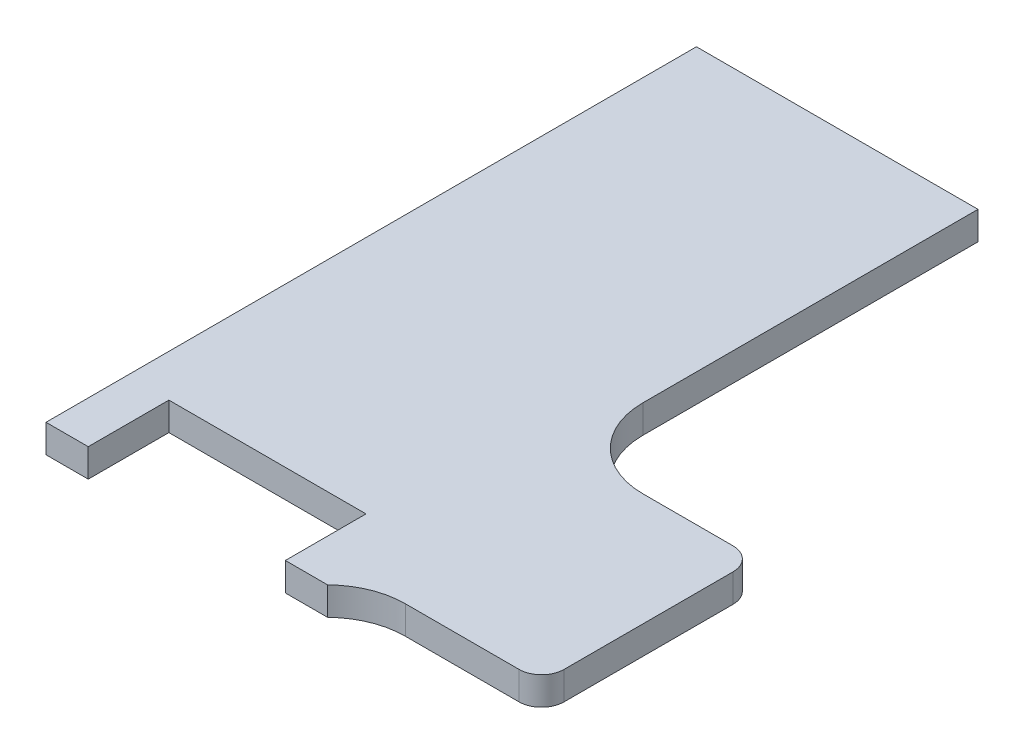
ISO-10303-21;
HEADER;
FILE_DESCRIPTION(('STEP AP214'),'2;1');
FILE_NAME('part.step','',(''),(''),'','','');
FILE_SCHEMA(('AUTOMOTIVE_DESIGN { 1 0 10303 214 1 1 1 1 }'));
ENDSEC;
DATA;
#1=APPLICATION_CONTEXT('core data for automotive mechanical design processes');
#2=APPLICATION_PROTOCOL_DEFINITION('international standard','automotive_design',2000,#1);
#3=PRODUCT_CONTEXT('',#1,'mechanical');
#4=PRODUCT('Part','Part','',(#3));
#5=PRODUCT_RELATED_PRODUCT_CATEGORY('part','',(#4));
#6=PRODUCT_DEFINITION_FORMATION('','',#4);
#7=PRODUCT_DEFINITION_CONTEXT('part definition',#1,'design');
#8=PRODUCT_DEFINITION('design','',#6,#7);
#9=PRODUCT_DEFINITION_SHAPE('','',#8);
#10=(LENGTH_UNIT() NAMED_UNIT(*) SI_UNIT(.MILLI.,.METRE.));
#11=(NAMED_UNIT(*) PLANE_ANGLE_UNIT() SI_UNIT($,.RADIAN.));
#12=(NAMED_UNIT(*) SI_UNIT($,.STERADIAN.) SOLID_ANGLE_UNIT());
#13=UNCERTAINTY_MEASURE_WITH_UNIT(LENGTH_MEASURE(1.E-05),#10,'distance_accuracy_value','');
#14=(GEOMETRIC_REPRESENTATION_CONTEXT(3) GLOBAL_UNCERTAINTY_ASSIGNED_CONTEXT((#13)) GLOBAL_UNIT_ASSIGNED_CONTEXT((#10,
#11,#12)) REPRESENTATION_CONTEXT('',''));
#15=CARTESIAN_POINT('',(0.,0.,0.));
#16=DIRECTION('',(0.,0.,1.));
#17=DIRECTION('',(1.,0.,0.));
#18=AXIS2_PLACEMENT_3D('',#15,#16,#17);
#19=CARTESIAN_POINT('',(31.75,39.6875,-24.765));
#20=DIRECTION('',(1.,0.,0.));
#21=DIRECTION('',(0.,0.,-1.));
#22=AXIS2_PLACEMENT_3D('',#19,#20,#21);
#23=PLANE('',#22);
#24=DIRECTION('',(0.,0.,-1.));
#25=VECTOR('',#24,1.);
#26=CARTESIAN_POINT('',(31.75,96.8375,20.32));
#27=LINE('',#26,#25);
#28=CARTESIAN_POINT('',(31.75,96.8375,-50.8));
#29=VERTEX_POINT('',#28);
#30=CARTESIAN_POINT('',(31.75,96.8375,-126.365));
#31=VERTEX_POINT('',#30);
#32=EDGE_CURVE('E169',#29,#31,#27,.T.);
#33=ORIENTED_EDGE('',*,*,#32,.F.);
#34=DIRECTION('',(0.,1.,0.));
#35=VECTOR('',#34,1.);
#36=CARTESIAN_POINT('',(31.75,90.4875,-50.8));
#37=LINE('',#36,#35);
#38=CARTESIAN_POINT('',(31.75,90.4875,-50.8));
#39=VERTEX_POINT('',#38);
#40=EDGE_CURVE('E201',#29,#39,#37,.F.);
#41=ORIENTED_EDGE('',*,*,#40,.T.);
#42=DIRECTION('',(0.,0.,-1.));
#43=VECTOR('',#42,1.);
#44=CARTESIAN_POINT('',(31.75,90.4875,-24.765));
#45=LINE('',#44,#43);
#46=CARTESIAN_POINT('',(31.75,90.4875,-126.365));
#47=VERTEX_POINT('',#46);
#48=EDGE_CURVE('E181',#39,#47,#45,.T.);
#49=ORIENTED_EDGE('',*,*,#48,.T.);
#50=DIRECTION('',(0.,-1.,0.));
#51=VECTOR('',#50,1.);
#52=CARTESIAN_POINT('',(31.75,96.8375,-126.365));
#53=LINE('',#52,#51);
#54=EDGE_CURVE('E190',#31,#47,#53,.T.);
#55=ORIENTED_EDGE('',*,*,#54,.F.);
#56=EDGE_LOOP('',(#33,#41,#49,#55));
#57=FACE_BOUND('',#56,.T.);
#58=ADVANCED_FACE('F36',(#57),#23,.T.);
#59=CARTESIAN_POINT('',(-31.75,96.8375,20.32));
#60=DIRECTION('',(0.,0.,-1.));
#61=DIRECTION('',(-1.,0.,0.));
#62=AXIS2_PLACEMENT_3D('',#59,#60,#61);
#63=PLANE('',#62);
#64=DIRECTION('',(0.,1.,0.));
#65=VECTOR('',#64,1.);
#66=CARTESIAN_POINT('',(-22.225,-0.00100000000002876,20.32));
#67=LINE('',#66,#65);
#68=CARTESIAN_POINT('',(-22.225,90.4875,20.32));
#69=VERTEX_POINT('',#68);
#70=CARTESIAN_POINT('',(-22.225,96.8375,20.32));
#71=VERTEX_POINT('',#70);
#72=EDGE_CURVE('E145',#69,#71,#67,.T.);
#73=ORIENTED_EDGE('',*,*,#72,.T.);
#74=DIRECTION('',(1.,0.,0.));
#75=VECTOR('',#74,1.);
#76=CARTESIAN_POINT('',(-31.75,96.8375,20.32));
#77=LINE('',#76,#75);
#78=CARTESIAN_POINT('',(-31.75,96.8375,20.32));
#79=VERTEX_POINT('',#78);
#80=EDGE_CURVE('E159',#79,#71,#77,.T.);
#81=ORIENTED_EDGE('',*,*,#80,.F.);
#82=DIRECTION('',(0.,-1.,0.));
#83=VECTOR('',#82,1.);
#84=CARTESIAN_POINT('',(-31.75,96.8375,20.32));
#85=LINE('',#84,#83);
#86=CARTESIAN_POINT('',(-31.75,90.4875,20.32));
#87=VERTEX_POINT('',#86);
#88=EDGE_CURVE('E196',#79,#87,#85,.T.);
#89=ORIENTED_EDGE('',*,*,#88,.T.);
#90=DIRECTION('',(1.,0.,0.));
#91=VECTOR('',#90,1.);
#92=CARTESIAN_POINT('',(-31.75,90.4875,20.32));
#93=LINE('',#92,#91);
#94=EDGE_CURVE('E161',#87,#69,#93,.T.);
#95=ORIENTED_EDGE('',*,*,#94,.T.);
#96=EDGE_LOOP('',(#73,#81,#89,#95));
#97=FACE_BOUND('',#96,.T.);
#98=ADVANCED_FACE('F157',(#97),#63,.F.);
#99=CARTESIAN_POINT('',(0.,96.8375,0.));
#100=DIRECTION('',(0.,1.,0.));
#101=DIRECTION('',(-1.,0.,0.));
#102=AXIS2_PLACEMENT_3D('',#99,#100,#101);
#103=PLANE('',#102);
#104=DIRECTION('',(0.,0.,-1.));
#105=VECTOR('',#104,1.);
#106=CARTESIAN_POINT('',(74.93,96.8375,15.24));
#107=LINE('',#106,#105);
#108=CARTESIAN_POINT('',(74.93,96.8375,10.16));
#109=VERTEX_POINT('',#108);
#110=CARTESIAN_POINT('',(74.93,96.8375,-27.94));
#111=VERTEX_POINT('',#110);
#112=EDGE_CURVE('E232',#109,#111,#107,.T.);
#113=ORIENTED_EDGE('',*,*,#112,.T.);
#114=CARTESIAN_POINT('',(69.85,96.8375,-27.94));
#115=DIRECTION('',(0.,1.,0.));
#116=DIRECTION('',(-1.,0.,0.));
#117=AXIS2_PLACEMENT_3D('',#114,#115,#116);
#118=CIRCLE('',#117,5.08);
#119=CARTESIAN_POINT('',(69.85,96.8375,-33.02));
#120=VERTEX_POINT('',#119);
#121=EDGE_CURVE('E58',#111,#120,#118,.T.);
#122=ORIENTED_EDGE('',*,*,#121,.T.);
#123=DIRECTION('',(-1.,0.,0.));
#124=VECTOR('',#123,1.);
#125=CARTESIAN_POINT('',(31.75,96.8375,-33.02));
#126=LINE('',#125,#124);
#127=CARTESIAN_POINT('',(49.53,96.8375,-33.02));
#128=VERTEX_POINT('',#127);
#129=EDGE_CURVE('E238',#120,#128,#126,.T.);
#130=ORIENTED_EDGE('',*,*,#129,.T.);
#131=CARTESIAN_POINT('',(49.53,96.8375,-50.8));
#132=DIRECTION('',(0.,1.,0.));
#133=DIRECTION('',(-1.,0.,0.));
#134=AXIS2_PLACEMENT_3D('',#131,#132,#133);
#135=CIRCLE('',#134,17.78);
#136=EDGE_CURVE('E203',#128,#29,#135,.F.);
#137=ORIENTED_EDGE('',*,*,#136,.T.);
#138=ORIENTED_EDGE('',*,*,#32,.T.);
#139=DIRECTION('',(-1.,0.,0.));
#140=VECTOR('',#139,1.);
#141=CARTESIAN_POINT('',(31.75,96.8375,-126.365));
#142=LINE('',#141,#140);
#143=CARTESIAN_POINT('',(-31.75,96.8375,-126.365));
#144=VERTEX_POINT('',#143);
#145=EDGE_CURVE('E172',#31,#144,#142,.T.);
#146=ORIENTED_EDGE('',*,*,#145,.T.);
#147=DIRECTION('',(0.,0.,1.));
#148=VECTOR('',#147,1.);
#149=CARTESIAN_POINT('',(-31.75,96.8375,-24.765));
#150=LINE('',#149,#148);
#151=EDGE_CURVE('E167',#144,#79,#150,.T.);
#152=ORIENTED_EDGE('',*,*,#151,.T.);
#153=ORIENTED_EDGE('',*,*,#80,.T.);
#154=DIRECTION('',(0.,0.,-1.));
#155=VECTOR('',#154,1.);
#156=CARTESIAN_POINT('',(-22.225,96.8375,41.1636421541246));
#157=LINE('',#156,#155);
#158=CARTESIAN_POINT('',(-22.225,96.8375,2.13002217265057));
#159=VERTEX_POINT('',#158);
#160=EDGE_CURVE('E141',#71,#159,#157,.T.);
#161=ORIENTED_EDGE('',*,*,#160,.T.);
#162=DIRECTION('',(-1.,0.,0.));
#163=VECTOR('',#162,1.);
#164=CARTESIAN_POINT('',(22.225,96.8375,2.13002217265057));
#165=LINE('',#164,#163);
#166=CARTESIAN_POINT('',(22.225,96.8375,2.13002217265057));
#167=VERTEX_POINT('',#166);
#168=EDGE_CURVE('E152',#167,#159,#165,.T.);
#169=ORIENTED_EDGE('',*,*,#168,.F.);
#170=DIRECTION('',(0.,0.,-1.));
#171=VECTOR('',#170,1.);
#172=CARTESIAN_POINT('',(22.225,96.8375,41.1636421541246));
#173=LINE('',#172,#171);
#174=CARTESIAN_POINT('',(22.225,96.8375,20.32));
#175=VERTEX_POINT('',#174);
#176=EDGE_CURVE('E252',#175,#167,#173,.T.);
#177=ORIENTED_EDGE('',*,*,#176,.F.);
#178=CARTESIAN_POINT('',(31.75,96.8375,20.32));
#179=VERTEX_POINT('',#178);
#180=EDGE_CURVE('E170',#175,#179,#77,.T.);
#181=ORIENTED_EDGE('',*,*,#180,.T.);
#182=CARTESIAN_POINT('',(44.1934078933385,96.8375,33.02));
#183=DIRECTION('',(0.,1.,0.));
#184=DIRECTION('',(-1.,0.,0.));
#185=AXIS2_PLACEMENT_3D('',#182,#183,#184);
#186=CIRCLE('',#185,17.78);
#187=CARTESIAN_POINT('',(44.1934078933385,96.8375,15.24));
#188=VERTEX_POINT('',#187);
#189=EDGE_CURVE('E210',#179,#188,#186,.F.);
#190=ORIENTED_EDGE('',*,*,#189,.T.);
#191=DIRECTION('',(1.,0.,0.));
#192=VECTOR('',#191,1.);
#193=CARTESIAN_POINT('',(31.75,96.8375,15.24));
#194=LINE('',#193,#192);
#195=CARTESIAN_POINT('',(69.85,96.8375,15.24));
#196=VERTEX_POINT('',#195);
#197=EDGE_CURVE('E239',#188,#196,#194,.T.);
#198=ORIENTED_EDGE('',*,*,#197,.T.);
#199=CARTESIAN_POINT('',(69.85,96.8375,10.16));
#200=DIRECTION('',(0.,1.,0.));
#201=DIRECTION('',(-1.,0.,0.));
#202=AXIS2_PLACEMENT_3D('',#199,#200,#201);
#203=CIRCLE('',#202,5.08);
#204=EDGE_CURVE('E217',#196,#109,#203,.T.);
#205=ORIENTED_EDGE('',*,*,#204,.T.);
#206=EDGE_LOOP('',(#113,#122,#130,#137,#138,#146,#152,#153,#161,#169,#177,#181,#190,#198,#205));
#207=FACE_BOUND('',#206,.T.);
#208=ADVANCED_FACE('F165',(#207),#103,.T.);
#209=CARTESIAN_POINT('',(-31.75,90.4875,-24.765));
#210=DIRECTION('',(-1.,0.,0.));
#211=DIRECTION('',(0.,-1.,0.));
#212=AXIS2_PLACEMENT_3D('',#209,#210,#211);
#213=PLANE('',#212);
#214=DIRECTION('',(0.,0.,1.));
#215=VECTOR('',#214,1.);
#216=CARTESIAN_POINT('',(-31.75,90.4875,-24.765));
#217=LINE('',#216,#215);
#218=CARTESIAN_POINT('',(-31.75,90.4875,-126.365));
#219=VERTEX_POINT('',#218);
#220=EDGE_CURVE('E186',#219,#87,#217,.T.);
#221=ORIENTED_EDGE('',*,*,#220,.T.);
#222=ORIENTED_EDGE('',*,*,#88,.F.);
#223=ORIENTED_EDGE('',*,*,#151,.F.);
#224=DIRECTION('',(0.,-1.,0.));
#225=VECTOR('',#224,1.);
#226=CARTESIAN_POINT('',(-31.75,96.8375,-126.365));
#227=LINE('',#226,#225);
#228=EDGE_CURVE('E179',#144,#219,#227,.T.);
#229=ORIENTED_EDGE('',*,*,#228,.T.);
#230=EDGE_LOOP('',(#221,#222,#223,#229));
#231=FACE_BOUND('',#230,.T.);
#232=ADVANCED_FACE('F283',(#231),#213,.T.);
#233=CARTESIAN_POINT('',(0.,90.4875,0.));
#234=DIRECTION('',(0.,1.,0.));
#235=DIRECTION('',(-1.,0.,0.));
#236=AXIS2_PLACEMENT_3D('',#233,#234,#235);
#237=PLANE('',#236);
#238=ORIENTED_EDGE('',*,*,#94,.F.);
#239=ORIENTED_EDGE('',*,*,#220,.F.);
#240=DIRECTION('',(-1.,0.,0.));
#241=VECTOR('',#240,1.);
#242=CARTESIAN_POINT('',(31.75,90.4875,-126.365));
#243=LINE('',#242,#241);
#244=EDGE_CURVE('E184',#47,#219,#243,.T.);
#245=ORIENTED_EDGE('',*,*,#244,.F.);
#246=ORIENTED_EDGE('',*,*,#48,.F.);
#247=CARTESIAN_POINT('',(49.53,90.4875,-50.8));
#248=DIRECTION('',(0.,1.,0.));
#249=DIRECTION('',(-1.,0.,0.));
#250=AXIS2_PLACEMENT_3D('',#247,#248,#249);
#251=CIRCLE('',#250,17.78);
#252=CARTESIAN_POINT('',(49.53,90.4875,-33.02));
#253=VERTEX_POINT('',#252);
#254=EDGE_CURVE('E205',#39,#253,#251,.T.);
#255=ORIENTED_EDGE('',*,*,#254,.T.);
#256=DIRECTION('',(1.,0.,0.));
#257=VECTOR('',#256,1.);
#258=CARTESIAN_POINT('',(31.75,90.4875,-33.02));
#259=LINE('',#258,#257);
#260=CARTESIAN_POINT('',(69.85,90.4875,-33.02));
#261=VERTEX_POINT('',#260);
#262=EDGE_CURVE('E245',#253,#261,#259,.T.);
#263=ORIENTED_EDGE('',*,*,#262,.T.);
#264=CARTESIAN_POINT('',(69.85,90.4875,-27.94));
#265=DIRECTION('',(0.,1.,0.));
#266=DIRECTION('',(-1.,0.,0.));
#267=AXIS2_PLACEMENT_3D('',#264,#265,#266);
#268=CIRCLE('',#267,5.08);
#269=CARTESIAN_POINT('',(74.93,90.4875,-27.94));
#270=VERTEX_POINT('',#269);
#271=EDGE_CURVE('E11',#261,#270,#268,.F.);
#272=ORIENTED_EDGE('',*,*,#271,.T.);
#273=DIRECTION('',(0.,0.,1.));
#274=VECTOR('',#273,1.);
#275=CARTESIAN_POINT('',(74.93,90.4875,15.24));
#276=LINE('',#275,#274);
#277=CARTESIAN_POINT('',(74.93,90.4875,10.16));
#278=VERTEX_POINT('',#277);
#279=EDGE_CURVE('E234',#270,#278,#276,.T.);
#280=ORIENTED_EDGE('',*,*,#279,.T.);
#281=CARTESIAN_POINT('',(69.85,90.4875,10.16));
#282=DIRECTION('',(0.,1.,0.));
#283=DIRECTION('',(-1.,0.,0.));
#284=AXIS2_PLACEMENT_3D('',#281,#282,#283);
#285=CIRCLE('',#284,5.08);
#286=CARTESIAN_POINT('',(69.85,90.4875,15.24));
#287=VERTEX_POINT('',#286);
#288=EDGE_CURVE('E222',#278,#287,#285,.F.);
#289=ORIENTED_EDGE('',*,*,#288,.T.);
#290=DIRECTION('',(-1.,0.,0.));
#291=VECTOR('',#290,1.);
#292=CARTESIAN_POINT('',(31.75,90.4875,15.24));
#293=LINE('',#292,#291);
#294=CARTESIAN_POINT('',(44.1934078933385,90.4875,15.24));
#295=VERTEX_POINT('',#294);
#296=EDGE_CURVE('E163',#287,#295,#293,.T.);
#297=ORIENTED_EDGE('',*,*,#296,.T.);
#298=CARTESIAN_POINT('',(44.1934078933385,90.4875,33.02));
#299=DIRECTION('',(0.,1.,0.));
#300=DIRECTION('',(-1.,0.,0.));
#301=AXIS2_PLACEMENT_3D('',#298,#299,#300);
#302=CIRCLE('',#301,17.78);
#303=CARTESIAN_POINT('',(31.75,90.4875,20.32));
#304=VERTEX_POINT('',#303);
#305=EDGE_CURVE('E212',#295,#304,#302,.T.);
#306=ORIENTED_EDGE('',*,*,#305,.T.);
#307=CARTESIAN_POINT('',(22.225,90.4875,20.32));
#308=VERTEX_POINT('',#307);
#309=EDGE_CURVE('E182',#308,#304,#93,.T.);
#310=ORIENTED_EDGE('',*,*,#309,.F.);
#311=DIRECTION('',(0.,0.,1.));
#312=VECTOR('',#311,1.);
#313=CARTESIAN_POINT('',(22.225,90.4875,41.1636421541246));
#314=LINE('',#313,#312);
#315=CARTESIAN_POINT('',(22.225,90.4875,2.13002217265057));
#316=VERTEX_POINT('',#315);
#317=EDGE_CURVE('E250',#316,#308,#314,.T.);
#318=ORIENTED_EDGE('',*,*,#317,.F.);
#319=DIRECTION('',(1.,0.,0.));
#320=VECTOR('',#319,1.);
#321=CARTESIAN_POINT('',(22.225,90.4875,2.13002217265057));
#322=LINE('',#321,#320);
#323=CARTESIAN_POINT('',(-22.225,90.4875,2.13002217265057));
#324=VERTEX_POINT('',#323);
#325=EDGE_CURVE('E257',#324,#316,#322,.T.);
#326=ORIENTED_EDGE('',*,*,#325,.F.);
#327=DIRECTION('',(0.,0.,1.));
#328=VECTOR('',#327,1.);
#329=CARTESIAN_POINT('',(-22.225,90.4875,41.1636421541246));
#330=LINE('',#329,#328);
#331=EDGE_CURVE('E248',#324,#69,#330,.T.);
#332=ORIENTED_EDGE('',*,*,#331,.T.);
#333=EDGE_LOOP('',(#238,#239,#245,#246,#255,#263,#272,#280,#289,#297,#306,#310,#318,#326,#332));
#334=FACE_BOUND('',#333,.T.);
#335=ADVANCED_FACE('F278',(#334),#237,.F.);
#336=ORIENTED_EDGE('',*,*,#180,.F.);
#337=DIRECTION('',(0.,1.,0.));
#338=VECTOR('',#337,1.);
#339=CARTESIAN_POINT('',(22.225,-0.00100000000002876,20.32));
#340=LINE('',#339,#338);
#341=EDGE_CURVE('E162',#308,#175,#340,.T.);
#342=ORIENTED_EDGE('',*,*,#341,.F.);
#343=ORIENTED_EDGE('',*,*,#309,.T.);
#344=DIRECTION('',(0.,-1.,0.));
#345=VECTOR('',#344,1.);
#346=CARTESIAN_POINT('',(31.75,96.8375,20.32));
#347=LINE('',#346,#345);
#348=EDGE_CURVE('E193',#179,#304,#347,.T.);
#349=ORIENTED_EDGE('',*,*,#348,.F.);
#350=EDGE_LOOP('',(#336,#342,#343,#349));
#351=FACE_BOUND('',#350,.T.);
#352=ADVANCED_FACE('F267',(#351),#63,.F.);
#353=CARTESIAN_POINT('',(31.75,96.8375,-126.365));
#354=DIRECTION('',(0.,0.,1.));
#355=DIRECTION('',(1.,0.,0.));
#356=AXIS2_PLACEMENT_3D('',#353,#354,#355);
#357=PLANE('',#356);
#358=ORIENTED_EDGE('',*,*,#244,.T.);
#359=ORIENTED_EDGE('',*,*,#228,.F.);
#360=ORIENTED_EDGE('',*,*,#145,.F.);
#361=ORIENTED_EDGE('',*,*,#54,.T.);
#362=EDGE_LOOP('',(#358,#359,#360,#361));
#363=FACE_BOUND('',#362,.T.);
#364=ADVANCED_FACE('F287',(#363),#357,.F.);
#365=CARTESIAN_POINT('',(22.225,-0.00100000000002876,2.13002217265057));
#366=DIRECTION('',(0.,0.,-1.));
#367=DIRECTION('',(-1.,0.,0.));
#368=AXIS2_PLACEMENT_3D('',#365,#366,#367);
#369=PLANE('',#368);
#370=ORIENTED_EDGE('',*,*,#325,.T.);
#371=DIRECTION('',(0.,1.,0.));
#372=VECTOR('',#371,1.);
#373=CARTESIAN_POINT('',(22.225,-0.00100000000002876,2.13002217265057));
#374=LINE('',#373,#372);
#375=EDGE_CURVE('E151',#316,#167,#374,.T.);
#376=ORIENTED_EDGE('',*,*,#375,.T.);
#377=ORIENTED_EDGE('',*,*,#168,.T.);
#378=DIRECTION('',(0.,1.,0.));
#379=VECTOR('',#378,1.);
#380=CARTESIAN_POINT('',(-22.225,-0.00100000000002876,2.13002217265057));
#381=LINE('',#380,#379);
#382=EDGE_CURVE('E147',#324,#159,#381,.T.);
#383=ORIENTED_EDGE('',*,*,#382,.F.);
#384=EDGE_LOOP('',(#370,#376,#377,#383));
#385=FACE_BOUND('',#384,.T.);
#386=ADVANCED_FACE('F369',(#385),#369,.F.);
#387=CARTESIAN_POINT('',(-22.225,-0.00100000000002876,41.1636421541246));
#388=DIRECTION('',(1.,0.,0.));
#389=DIRECTION('',(0.,1.,0.));
#390=AXIS2_PLACEMENT_3D('',#387,#388,#389);
#391=PLANE('',#390);
#392=ORIENTED_EDGE('',*,*,#331,.F.);
#393=ORIENTED_EDGE('',*,*,#382,.T.);
#394=ORIENTED_EDGE('',*,*,#160,.F.);
#395=ORIENTED_EDGE('',*,*,#72,.F.);
#396=EDGE_LOOP('',(#392,#393,#394,#395));
#397=FACE_BOUND('',#396,.T.);
#398=ADVANCED_FACE('F144',(#397),#391,.T.);
#399=CARTESIAN_POINT('',(22.225,-0.00100000000002876,41.1636421541246));
#400=DIRECTION('',(1.,0.,0.));
#401=DIRECTION('',(0.,1.,0.));
#402=AXIS2_PLACEMENT_3D('',#399,#400,#401);
#403=PLANE('',#402);
#404=ORIENTED_EDGE('',*,*,#341,.T.);
#405=ORIENTED_EDGE('',*,*,#176,.T.);
#406=ORIENTED_EDGE('',*,*,#375,.F.);
#407=ORIENTED_EDGE('',*,*,#317,.T.);
#408=EDGE_LOOP('',(#404,#405,#406,#407));
#409=FACE_BOUND('',#408,.T.);
#410=ADVANCED_FACE('F277',(#409),#403,.F.);
#411=CARTESIAN_POINT('',(31.75,25.7299521773716,-33.02));
#412=DIRECTION('',(0.,0.,-1.));
#413=DIRECTION('',(-1.,0.,0.));
#414=AXIS2_PLACEMENT_3D('',#411,#412,#413);
#415=PLANE('',#414);
#416=ORIENTED_EDGE('',*,*,#129,.F.);
#417=DIRECTION('',(0.,1.,0.));
#418=VECTOR('',#417,1.);
#419=CARTESIAN_POINT('',(69.85,25.7299521773716,-33.02));
#420=LINE('',#419,#418);
#421=EDGE_CURVE('E44',#120,#261,#420,.F.);
#422=ORIENTED_EDGE('',*,*,#421,.T.);
#423=ORIENTED_EDGE('',*,*,#262,.F.);
#424=DIRECTION('',(0.,1.,0.));
#425=VECTOR('',#424,1.);
#426=CARTESIAN_POINT('',(49.53,96.8375,-33.02));
#427=LINE('',#426,#425);
#428=EDGE_CURVE('E198',#253,#128,#427,.T.);
#429=ORIENTED_EDGE('',*,*,#428,.T.);
#430=EDGE_LOOP('',(#416,#422,#423,#429));
#431=FACE_BOUND('',#430,.T.);
#432=ADVANCED_FACE('F297',(#431),#415,.T.);
#433=CARTESIAN_POINT('',(74.9299999999999,25.7299521773716,15.24));
#434=DIRECTION('',(1.,0.,0.));
#435=DIRECTION('',(0.,1.,0.));
#436=AXIS2_PLACEMENT_3D('',#433,#434,#435);
#437=PLANE('',#436);
#438=ORIENTED_EDGE('',*,*,#279,.F.);
#439=DIRECTION('',(0.,1.,0.));
#440=VECTOR('',#439,1.);
#441=CARTESIAN_POINT('',(74.9299999999999,25.7299521773716,-27.94));
#442=LINE('',#441,#440);
#443=EDGE_CURVE('E224',#270,#111,#442,.T.);
#444=ORIENTED_EDGE('',*,*,#443,.T.);
#445=ORIENTED_EDGE('',*,*,#112,.F.);
#446=DIRECTION('',(0.,1.,0.));
#447=VECTOR('',#446,1.);
#448=CARTESIAN_POINT('',(74.9299999999999,25.7299521773716,10.16));
#449=LINE('',#448,#447);
#450=EDGE_CURVE('E219',#109,#278,#449,.F.);
#451=ORIENTED_EDGE('',*,*,#450,.T.);
#452=EDGE_LOOP('',(#438,#444,#445,#451));
#453=FACE_BOUND('',#452,.T.);
#454=ADVANCED_FACE('F231',(#453),#437,.T.);
#455=CARTESIAN_POINT('',(31.75,25.7299521773716,15.24));
#456=DIRECTION('',(0.,0.,1.));
#457=DIRECTION('',(1.,0.,0.));
#458=AXIS2_PLACEMENT_3D('',#455,#456,#457);
#459=PLANE('',#458);
#460=ORIENTED_EDGE('',*,*,#296,.F.);
#461=DIRECTION('',(0.,1.,0.));
#462=VECTOR('',#461,1.);
#463=CARTESIAN_POINT('',(69.85,25.7299521773716,15.24));
#464=LINE('',#463,#462);
#465=EDGE_CURVE('E214',#287,#196,#464,.T.);
#466=ORIENTED_EDGE('',*,*,#465,.T.);
#467=ORIENTED_EDGE('',*,*,#197,.F.);
#468=DIRECTION('',(0.,-1.,0.));
#469=VECTOR('',#468,1.);
#470=CARTESIAN_POINT('',(44.1934078933385,90.4875,15.24));
#471=LINE('',#470,#469);
#472=EDGE_CURVE('E207',#188,#295,#471,.T.);
#473=ORIENTED_EDGE('',*,*,#472,.T.);
#474=EDGE_LOOP('',(#460,#466,#467,#473));
#475=FACE_BOUND('',#474,.T.);
#476=ADVANCED_FACE('F305',(#475),#459,.T.);
#477=CARTESIAN_POINT('',(49.53,25.7299521773716,-50.8));
#478=DIRECTION('',(0.,-1.,0.));
#479=DIRECTION('',(0.,0.,-1.));
#480=AXIS2_PLACEMENT_3D('',#477,#478,#479);
#481=CYLINDRICAL_SURFACE('',#480,17.78);
#482=ORIENTED_EDGE('',*,*,#254,.F.);
#483=ORIENTED_EDGE('',*,*,#40,.F.);
#484=ORIENTED_EDGE('',*,*,#136,.F.);
#485=ORIENTED_EDGE('',*,*,#428,.F.);
#486=EDGE_LOOP('',(#482,#483,#484,#485));
#487=FACE_BOUND('',#486,.T.);
#488=ADVANCED_FACE('F295',(#487),#481,.F.);
#489=CARTESIAN_POINT('',(44.1934078933385,39.6875,33.02));
#490=DIRECTION('',(0.,1.,0.));
#491=DIRECTION('',(0.,0.,1.));
#492=AXIS2_PLACEMENT_3D('',#489,#490,#491);
#493=CYLINDRICAL_SURFACE('',#492,17.78);
#494=ORIENTED_EDGE('',*,*,#305,.F.);
#495=ORIENTED_EDGE('',*,*,#472,.F.);
#496=ORIENTED_EDGE('',*,*,#189,.F.);
#497=ORIENTED_EDGE('',*,*,#348,.T.);
#498=EDGE_LOOP('',(#494,#495,#496,#497));
#499=FACE_BOUND('',#498,.T.);
#500=ADVANCED_FACE('F272',(#499),#493,.F.);
#501=CARTESIAN_POINT('',(69.85,25.7299521773716,10.16));
#502=DIRECTION('',(0.,1.,0.));
#503=DIRECTION('',(-1.,0.,0.));
#504=AXIS2_PLACEMENT_3D('',#501,#502,#503);
#505=CYLINDRICAL_SURFACE('',#504,5.08);
#506=ORIENTED_EDGE('',*,*,#288,.F.);
#507=ORIENTED_EDGE('',*,*,#450,.F.);
#508=ORIENTED_EDGE('',*,*,#204,.F.);
#509=ORIENTED_EDGE('',*,*,#465,.F.);
#510=EDGE_LOOP('',(#506,#507,#508,#509));
#511=FACE_BOUND('',#510,.T.);
#512=ADVANCED_FACE('F303',(#511),#505,.T.);
#513=CARTESIAN_POINT('',(69.85,25.7299521773716,-27.94));
#514=DIRECTION('',(0.,1.,0.));
#515=DIRECTION('',(-1.,0.,0.));
#516=AXIS2_PLACEMENT_3D('',#513,#514,#515);
#517=CYLINDRICAL_SURFACE('',#516,5.08);
#518=ORIENTED_EDGE('',*,*,#271,.F.);
#519=ORIENTED_EDGE('',*,*,#421,.F.);
#520=ORIENTED_EDGE('',*,*,#121,.F.);
#521=ORIENTED_EDGE('',*,*,#443,.F.);
#522=EDGE_LOOP('',(#518,#519,#520,#521));
#523=FACE_BOUND('',#522,.T.);
#524=ADVANCED_FACE('F38',(#523),#517,.T.);
#525=CLOSED_SHELL('',(#58,#98,#208,#232,#335,#352,#364,#386,#398,#410,#432,#454,#476,#488,#500,
#512,#524));
#526=MANIFOLD_SOLID_BREP('B2',#525);
#527=ADVANCED_BREP_SHAPE_REPRESENTATION('',(#18,#526),#14);
#528=SHAPE_DEFINITION_REPRESENTATION(#9,#527);
ENDSEC;
END-ISO-10303-21;
